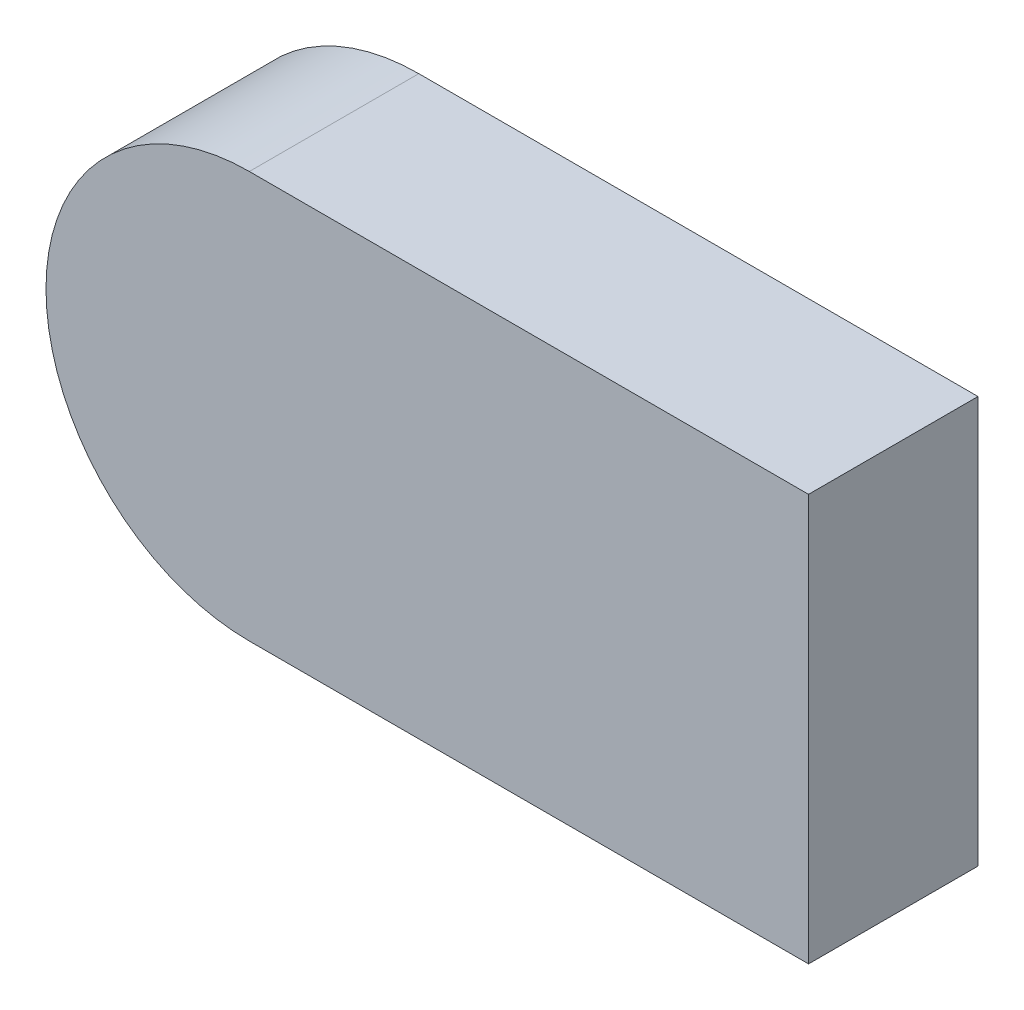
ISO-10303-21;
HEADER;
FILE_DESCRIPTION(('STEP AP214'),'2;1');
FILE_NAME('part.step','',(''),(''),'','','');
FILE_SCHEMA(('AUTOMOTIVE_DESIGN { 1 0 10303 214 1 1 1 1 }'));
ENDSEC;
DATA;
#1=APPLICATION_CONTEXT('core data for automotive mechanical design processes');
#2=APPLICATION_PROTOCOL_DEFINITION('international standard','automotive_design',2000,#1);
#3=PRODUCT_CONTEXT('',#1,'mechanical');
#4=PRODUCT('Part','Part','',(#3));
#5=PRODUCT_RELATED_PRODUCT_CATEGORY('part','',(#4));
#6=PRODUCT_DEFINITION_FORMATION('','',#4);
#7=PRODUCT_DEFINITION_CONTEXT('part definition',#1,'design');
#8=PRODUCT_DEFINITION('design','',#6,#7);
#9=PRODUCT_DEFINITION_SHAPE('','',#8);
#10=(LENGTH_UNIT() NAMED_UNIT(*) SI_UNIT(.MILLI.,.METRE.));
#11=(NAMED_UNIT(*) PLANE_ANGLE_UNIT() SI_UNIT($,.RADIAN.));
#12=(NAMED_UNIT(*) SI_UNIT($,.STERADIAN.) SOLID_ANGLE_UNIT());
#13=UNCERTAINTY_MEASURE_WITH_UNIT(LENGTH_MEASURE(1.E-05),#10,'distance_accuracy_value','');
#14=(GEOMETRIC_REPRESENTATION_CONTEXT(3) GLOBAL_UNCERTAINTY_ASSIGNED_CONTEXT((#13)) GLOBAL_UNIT_ASSIGNED_CONTEXT((#10,
#11,#12)) REPRESENTATION_CONTEXT('',''));
#15=CARTESIAN_POINT('',(0.,0.,0.));
#16=DIRECTION('',(0.,0.,1.));
#17=DIRECTION('',(1.,0.,0.));
#18=AXIS2_PLACEMENT_3D('',#15,#16,#17);
#19=CARTESIAN_POINT('',(4.05,2.63,0.));
#20=DIRECTION('',(0.,-1.,0.));
#21=DIRECTION('',(-1.,0.,0.));
#22=AXIS2_PLACEMENT_3D('',#19,#20,#21);
#23=PLANE('',#22);
#24=DIRECTION('',(0.,0.,1.));
#25=VECTOR('',#24,1.);
#26=CARTESIAN_POINT('',(4.05,2.63,0.));
#27=LINE('',#26,#25);
#28=CARTESIAN_POINT('',(4.05,2.63,0.));
#29=VERTEX_POINT('',#28);
#30=CARTESIAN_POINT('',(4.05,2.63,0.1));
#31=VERTEX_POINT('',#30);
#32=EDGE_CURVE('E11',#29,#31,#27,.T.);
#33=ORIENTED_EDGE('',*,*,#32,.T.);
#34=DIRECTION('',(-1.,0.,0.));
#35=VECTOR('',#34,1.);
#36=CARTESIAN_POINT('',(4.05,2.63,0.1));
#37=LINE('',#36,#35);
#38=CARTESIAN_POINT('',(3.72,2.63,0.1));
#39=VERTEX_POINT('',#38);
#40=EDGE_CURVE('E24',#31,#39,#37,.T.);
#41=ORIENTED_EDGE('',*,*,#40,.T.);
#42=DIRECTION('',(0.,0.,1.));
#43=VECTOR('',#42,1.);
#44=CARTESIAN_POINT('',(3.72,2.63,0.));
#45=LINE('',#44,#43);
#46=CARTESIAN_POINT('',(3.72,2.63,0.));
#47=VERTEX_POINT('',#46);
#48=EDGE_CURVE('E86',#47,#39,#45,.T.);
#49=ORIENTED_EDGE('',*,*,#48,.F.);
#50=DIRECTION('',(-1.,0.,0.));
#51=VECTOR('',#50,1.);
#52=CARTESIAN_POINT('',(4.05,2.63,0.));
#53=LINE('',#52,#51);
#54=EDGE_CURVE('E83',#29,#47,#53,.T.);
#55=ORIENTED_EDGE('',*,*,#54,.F.);
#56=EDGE_LOOP('',(#33,#41,#49,#55));
#57=FACE_BOUND('',#56,.T.);
#58=ADVANCED_FACE('F17',(#57),#23,.T.);
#59=CARTESIAN_POINT('',(3.72,2.75,0.));
#60=DIRECTION('',(0.,0.,-1.));
#61=DIRECTION('',(1.,0.,0.));
#62=AXIS2_PLACEMENT_3D('',#59,#60,#61);
#63=CYLINDRICAL_SURFACE('',#62,0.12);
#64=CARTESIAN_POINT('',(3.72,2.75,0.));
#65=DIRECTION('',(0.,0.,1.));
#66=DIRECTION('',(1.,0.,0.));
#67=AXIS2_PLACEMENT_3D('',#64,#65,#66);
#68=CIRCLE('',#67,0.12);
#69=CARTESIAN_POINT('',(3.72,2.87,0.));
#70=VERTEX_POINT('',#69);
#71=EDGE_CURVE('E80',#70,#47,#68,.T.);
#72=ORIENTED_EDGE('',*,*,#71,.T.);
#73=ORIENTED_EDGE('',*,*,#48,.T.);
#74=CARTESIAN_POINT('',(3.72,2.75,0.1));
#75=DIRECTION('',(0.,0.,1.));
#76=DIRECTION('',(1.,0.,0.));
#77=AXIS2_PLACEMENT_3D('',#74,#75,#76);
#78=CIRCLE('',#77,0.12);
#79=CARTESIAN_POINT('',(3.72,2.87,0.1));
#80=VERTEX_POINT('',#79);
#81=EDGE_CURVE('E78',#80,#39,#78,.T.);
#82=ORIENTED_EDGE('',*,*,#81,.F.);
#83=DIRECTION('',(0.,0.,1.));
#84=VECTOR('',#83,1.);
#85=CARTESIAN_POINT('',(3.72,2.87,0.));
#86=LINE('',#85,#84);
#87=EDGE_CURVE('E67',#70,#80,#86,.T.);
#88=ORIENTED_EDGE('',*,*,#87,.F.);
#89=EDGE_LOOP('',(#72,#73,#82,#88));
#90=FACE_BOUND('',#89,.T.);
#91=ADVANCED_FACE('F89',(#90),#63,.T.);
#92=CARTESIAN_POINT('',(4.05,2.87,0.));
#93=DIRECTION('',(0.,-1.,0.));
#94=DIRECTION('',(-1.,0.,0.));
#95=AXIS2_PLACEMENT_3D('',#92,#93,#94);
#96=PLANE('',#95);
#97=DIRECTION('',(-1.,0.,0.));
#98=VECTOR('',#97,1.);
#99=CARTESIAN_POINT('',(4.05,2.87,0.));
#100=LINE('',#99,#98);
#101=CARTESIAN_POINT('',(4.05,2.87,0.));
#102=VERTEX_POINT('',#101);
#103=EDGE_CURVE('E70',#102,#70,#100,.T.);
#104=ORIENTED_EDGE('',*,*,#103,.T.);
#105=ORIENTED_EDGE('',*,*,#87,.T.);
#106=DIRECTION('',(-1.,0.,0.));
#107=VECTOR('',#106,1.);
#108=CARTESIAN_POINT('',(4.05,2.87,0.1));
#109=LINE('',#108,#107);
#110=CARTESIAN_POINT('',(4.05,2.87,0.1));
#111=VERTEX_POINT('',#110);
#112=EDGE_CURVE('E61',#111,#80,#109,.T.);
#113=ORIENTED_EDGE('',*,*,#112,.F.);
#114=DIRECTION('',(0.,0.,1.));
#115=VECTOR('',#114,1.);
#116=CARTESIAN_POINT('',(4.05,2.87,0.));
#117=LINE('',#116,#115);
#118=EDGE_CURVE('E51',#102,#111,#117,.T.);
#119=ORIENTED_EDGE('',*,*,#118,.F.);
#120=EDGE_LOOP('',(#104,#105,#113,#119));
#121=FACE_BOUND('',#120,.T.);
#122=ADVANCED_FACE('F65',(#121),#96,.F.);
#123=CARTESIAN_POINT('',(4.05,2.63,0.));
#124=DIRECTION('',(-1.,0.,0.));
#125=DIRECTION('',(0.,1.,0.));
#126=AXIS2_PLACEMENT_3D('',#123,#124,#125);
#127=PLANE('',#126);
#128=DIRECTION('',(0.,1.,0.));
#129=VECTOR('',#128,1.);
#130=CARTESIAN_POINT('',(4.05,2.63,0.));
#131=LINE('',#130,#129);
#132=EDGE_CURVE('E57',#29,#102,#131,.T.);
#133=ORIENTED_EDGE('',*,*,#132,.T.);
#134=ORIENTED_EDGE('',*,*,#118,.T.);
#135=DIRECTION('',(0.,1.,0.));
#136=VECTOR('',#135,1.);
#137=CARTESIAN_POINT('',(4.05,2.63,0.1));
#138=LINE('',#137,#136);
#139=EDGE_CURVE('E55',#31,#111,#138,.T.);
#140=ORIENTED_EDGE('',*,*,#139,.F.);
#141=ORIENTED_EDGE('',*,*,#32,.F.);
#142=EDGE_LOOP('',(#133,#134,#140,#141));
#143=FACE_BOUND('',#142,.T.);
#144=ADVANCED_FACE('F53',(#143),#127,.F.);
#145=CARTESIAN_POINT('',(3.849490847913,2.75,0.));
#146=DIRECTION('',(0.,0.,-1.));
#147=DIRECTION('',(-1.,0.,0.));
#148=AXIS2_PLACEMENT_3D('',#145,#146,#147);
#149=PLANE('',#148);
#150=ORIENTED_EDGE('',*,*,#54,.T.);
#151=ORIENTED_EDGE('',*,*,#71,.F.);
#152=ORIENTED_EDGE('',*,*,#103,.F.);
#153=ORIENTED_EDGE('',*,*,#132,.F.);
#154=EDGE_LOOP('',(#150,#151,#152,#153));
#155=FACE_BOUND('',#154,.T.);
#156=ADVANCED_FACE('F91',(#155),#149,.T.);
#157=CARTESIAN_POINT('',(3.849490847913,2.75,0.1));
#158=DIRECTION('',(0.,0.,-1.));
#159=DIRECTION('',(-1.,0.,0.));
#160=AXIS2_PLACEMENT_3D('',#157,#158,#159);
#161=PLANE('',#160);
#162=ORIENTED_EDGE('',*,*,#139,.T.);
#163=ORIENTED_EDGE('',*,*,#112,.T.);
#164=ORIENTED_EDGE('',*,*,#81,.T.);
#165=ORIENTED_EDGE('',*,*,#40,.F.);
#166=EDGE_LOOP('',(#162,#163,#164,#165));
#167=FACE_BOUND('',#166,.T.);
#168=ADVANCED_FACE('F72',(#167),#161,.F.);
#169=CLOSED_SHELL('',(#58,#91,#122,#144,#156,#168));
#170=MANIFOLD_SOLID_BREP('B1',#169);
#171=ADVANCED_BREP_SHAPE_REPRESENTATION('',(#18,#170),#14);
#172=SHAPE_DEFINITION_REPRESENTATION(#9,#171);
ENDSEC;
END-ISO-10303-21;
